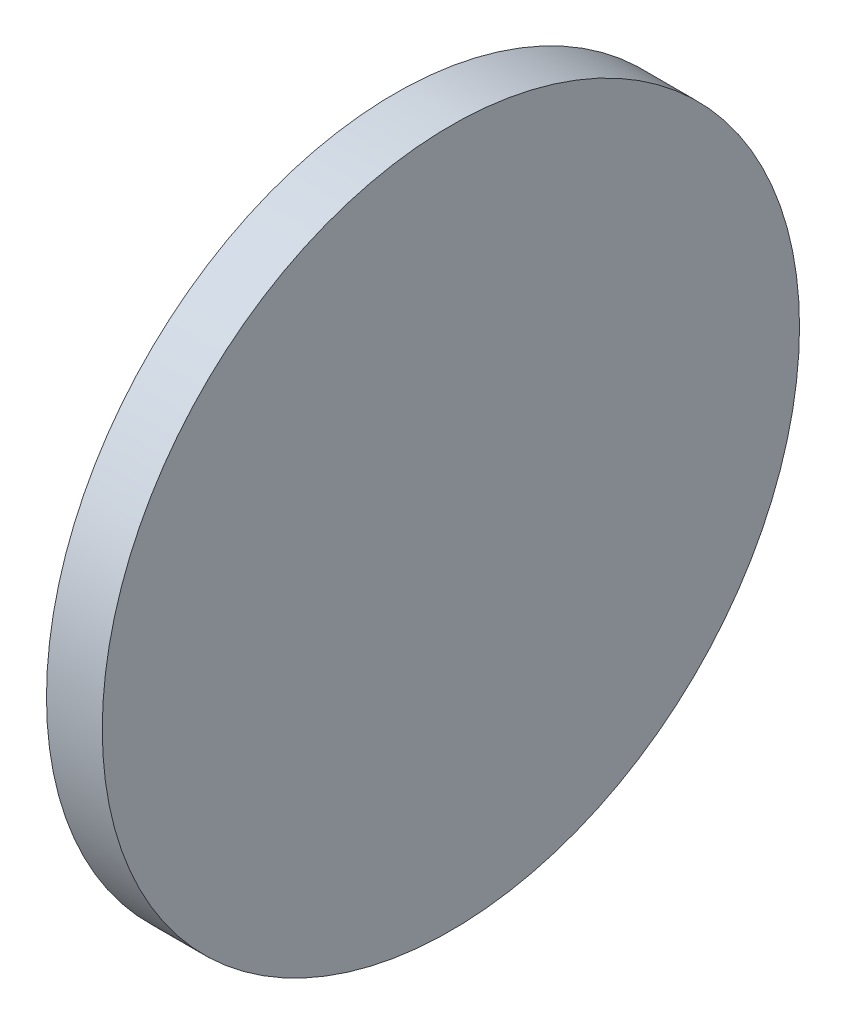
ISO-10303-21;
HEADER;
FILE_DESCRIPTION(('STEP AP214'),'2;1');
FILE_NAME('part.step','',(''),(''),'','','');
FILE_SCHEMA(('AUTOMOTIVE_DESIGN { 1 0 10303 214 1 1 1 1 }'));
ENDSEC;
DATA;
#1=APPLICATION_CONTEXT('core data for automotive mechanical design processes');
#2=APPLICATION_PROTOCOL_DEFINITION('international standard','automotive_design',2000,#1);
#3=PRODUCT_CONTEXT('',#1,'mechanical');
#4=PRODUCT('Part','Part','',(#3));
#5=PRODUCT_RELATED_PRODUCT_CATEGORY('part','',(#4));
#6=PRODUCT_DEFINITION_FORMATION('','',#4);
#7=PRODUCT_DEFINITION_CONTEXT('part definition',#1,'design');
#8=PRODUCT_DEFINITION('design','',#6,#7);
#9=PRODUCT_DEFINITION_SHAPE('','',#8);
#10=(LENGTH_UNIT() NAMED_UNIT(*) SI_UNIT(.MILLI.,.METRE.));
#11=(NAMED_UNIT(*) PLANE_ANGLE_UNIT() SI_UNIT($,.RADIAN.));
#12=(NAMED_UNIT(*) SI_UNIT($,.STERADIAN.) SOLID_ANGLE_UNIT());
#13=UNCERTAINTY_MEASURE_WITH_UNIT(LENGTH_MEASURE(1.E-05),#10,'distance_accuracy_value','');
#14=(GEOMETRIC_REPRESENTATION_CONTEXT(3) GLOBAL_UNCERTAINTY_ASSIGNED_CONTEXT((#13)) GLOBAL_UNIT_ASSIGNED_CONTEXT((#10,
#11,#12)) REPRESENTATION_CONTEXT('',''));
#15=CARTESIAN_POINT('',(0.,0.,0.));
#16=DIRECTION('',(0.,0.,1.));
#17=DIRECTION('',(1.,0.,0.));
#18=AXIS2_PLACEMENT_3D('',#15,#16,#17);
#19=CARTESIAN_POINT('',(520.369723165616,154.586358698031,0.));
#20=DIRECTION('',(1.,0.,0.));
#21=DIRECTION('',(0.,0.,-1.));
#22=AXIS2_PLACEMENT_3D('',#19,#20,#21);
#23=PLANE('',#22);
#24=CARTESIAN_POINT('',(520.369723165616,154.586358698031,0.));
#25=DIRECTION('',(-1.,0.,0.));
#26=DIRECTION('',(0.,0.,1.));
#27=AXIS2_PLACEMENT_3D('',#24,#25,#26);
#28=CIRCLE('',#27,25.);
#29=CARTESIAN_POINT('',(520.369723165616,154.586358698031,25.));
#30=VERTEX_POINT('',#29);
#31=EDGE_CURVE('E10',#30,#30,#28,.T.);
#32=ORIENTED_EDGE('',*,*,#31,.T.);
#33=EDGE_LOOP('',(#32));
#34=FACE_BOUND('',#33,.T.);
#35=ADVANCED_FACE('F35',(#34),#23,.F.);
#36=CARTESIAN_POINT('',(500.737567696577,154.586358698031,0.));
#37=DIRECTION('',(-1.,0.,0.));
#38=DIRECTION('',(0.,0.,1.));
#39=AXIS2_PLACEMENT_3D('',#36,#37,#38);
#40=CYLINDRICAL_SURFACE('',#39,25.);
#41=ORIENTED_EDGE('',*,*,#31,.F.);
#42=EDGE_LOOP('',(#41));
#43=FACE_BOUND('',#42,.T.);
#44=CARTESIAN_POINT('',(524.369723165616,154.586358698031,0.));
#45=DIRECTION('',(-1.,0.,0.));
#46=DIRECTION('',(0.,0.,1.));
#47=AXIS2_PLACEMENT_3D('',#44,#45,#46);
#48=CIRCLE('',#47,25.);
#49=CARTESIAN_POINT('',(524.369723165616,154.586358698031,25.));
#50=VERTEX_POINT('',#49);
#51=EDGE_CURVE('E41',#50,#50,#48,.T.);
#52=ORIENTED_EDGE('',*,*,#51,.T.);
#53=EDGE_LOOP('',(#52));
#54=FACE_BOUND('',#53,.T.);
#55=ADVANCED_FACE('F47',(#43,#54),#40,.T.);
#56=CARTESIAN_POINT('',(524.369723165616,179.586358698031,0.));
#57=DIRECTION('',(-1.,0.,0.));
#58=DIRECTION('',(0.,0.,1.));
#59=AXIS2_PLACEMENT_3D('',#56,#57,#58);
#60=PLANE('',#59);
#61=ORIENTED_EDGE('',*,*,#51,.F.);
#62=EDGE_LOOP('',(#61));
#63=FACE_BOUND('',#62,.T.);
#64=ADVANCED_FACE('F49',(#63),#60,.F.);
#65=CLOSED_SHELL('',(#35,#55,#64));
#66=MANIFOLD_SOLID_BREP('B2',#65);
#67=ADVANCED_BREP_SHAPE_REPRESENTATION('',(#18,#66),#14);
#68=SHAPE_DEFINITION_REPRESENTATION(#9,#67);
ENDSEC;
END-ISO-10303-21;
